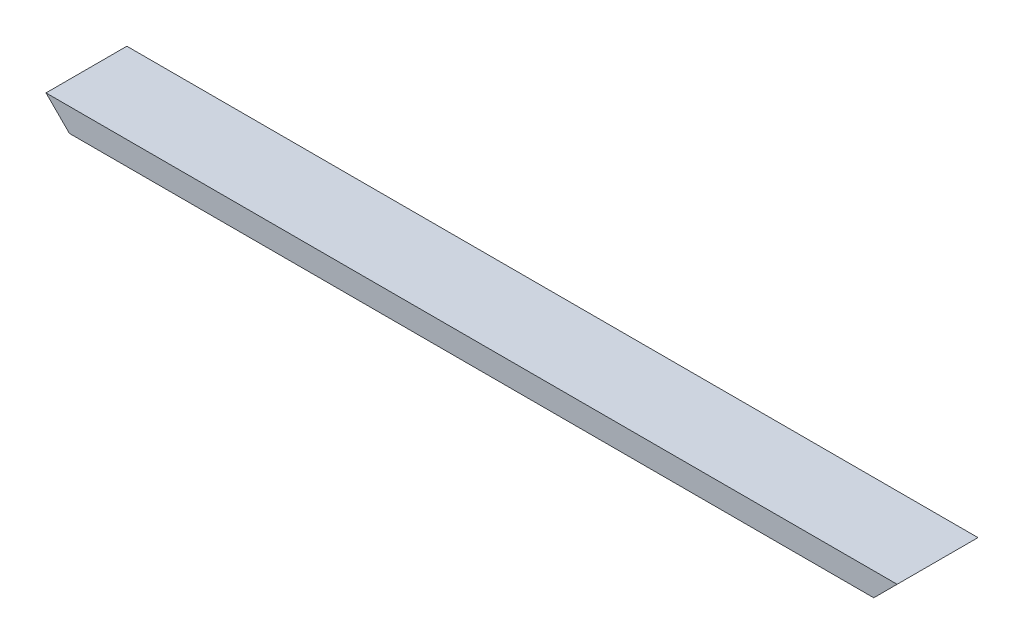
ISO-10303-21;
HEADER;
FILE_DESCRIPTION(('STEP AP214'),'2;1');
FILE_NAME('part.step','',(''),(''),'','','');
FILE_SCHEMA(('AUTOMOTIVE_DESIGN { 1 0 10303 214 1 1 1 1 }'));
ENDSEC;
DATA;
#1=APPLICATION_CONTEXT('core data for automotive mechanical design processes');
#2=APPLICATION_PROTOCOL_DEFINITION('international standard','automotive_design',2000,#1);
#3=PRODUCT_CONTEXT('',#1,'mechanical');
#4=PRODUCT('Part','Part','',(#3));
#5=PRODUCT_RELATED_PRODUCT_CATEGORY('part','',(#4));
#6=PRODUCT_DEFINITION_FORMATION('','',#4);
#7=PRODUCT_DEFINITION_CONTEXT('part definition',#1,'design');
#8=PRODUCT_DEFINITION('design','',#6,#7);
#9=PRODUCT_DEFINITION_SHAPE('','',#8);
#10=(LENGTH_UNIT() NAMED_UNIT(*) SI_UNIT(.MILLI.,.METRE.));
#11=(NAMED_UNIT(*) PLANE_ANGLE_UNIT() SI_UNIT($,.RADIAN.));
#12=(NAMED_UNIT(*) SI_UNIT($,.STERADIAN.) SOLID_ANGLE_UNIT());
#13=UNCERTAINTY_MEASURE_WITH_UNIT(LENGTH_MEASURE(1.E-05),#10,'distance_accuracy_value','');
#14=(GEOMETRIC_REPRESENTATION_CONTEXT(3) GLOBAL_UNCERTAINTY_ASSIGNED_CONTEXT((#13)) GLOBAL_UNIT_ASSIGNED_CONTEXT((#10,
#11,#12)) REPRESENTATION_CONTEXT('',''));
#15=CARTESIAN_POINT('',(0.,0.,0.));
#16=DIRECTION('',(0.,0.,1.));
#17=DIRECTION('',(1.,0.,0.));
#18=AXIS2_PLACEMENT_3D('',#15,#16,#17);
#19=CARTESIAN_POINT('',(400.,-5.5,-19.));
#20=DIRECTION('',(0.,0.,1.));
#21=DIRECTION('',(1.,0.,0.));
#22=AXIS2_PLACEMENT_3D('',#19,#20,#21);
#23=PLANE('',#22);
#24=DIRECTION('',(-1.,0.,0.));
#25=VECTOR('',#24,1.);
#26=CARTESIAN_POINT('',(400.,5.5,-19.));
#27=LINE('',#26,#25);
#28=CARTESIAN_POINT('',(400.,5.5,-19.));
#29=VERTEX_POINT('',#28);
#30=CARTESIAN_POINT('',(0.,5.5,-19.));
#31=VERTEX_POINT('',#30);
#32=EDGE_CURVE('E43',#29,#31,#27,.T.);
#33=ORIENTED_EDGE('',*,*,#32,.F.);
#34=DIRECTION('',(-0.707106781186544,-0.707106781186551,0.));
#35=VECTOR('',#34,1.);
#36=CARTESIAN_POINT('',(394.5,0.,-19.));
#37=LINE('',#36,#35);
#38=CARTESIAN_POINT('',(389.,-5.5,-19.));
#39=VERTEX_POINT('',#38);
#40=EDGE_CURVE('E58',#29,#39,#37,.T.);
#41=ORIENTED_EDGE('',*,*,#40,.T.);
#42=DIRECTION('',(-1.,0.,0.));
#43=VECTOR('',#42,1.);
#44=CARTESIAN_POINT('',(400.,-5.5,-19.));
#45=LINE('',#44,#43);
#46=CARTESIAN_POINT('',(10.9999999999998,-5.5,-19.));
#47=VERTEX_POINT('',#46);
#48=EDGE_CURVE('E120',#39,#47,#45,.T.);
#49=ORIENTED_EDGE('',*,*,#48,.T.);
#50=DIRECTION('',(0.707106781186543,-0.707106781186552,0.));
#51=VECTOR('',#50,1.);
#52=CARTESIAN_POINT('',(205.499999999997,-200.,-19.));
#53=LINE('',#52,#51);
#54=EDGE_CURVE('E132',#31,#47,#53,.T.);
#55=ORIENTED_EDGE('',*,*,#54,.F.);
#56=EDGE_LOOP('',(#33,#41,#49,#55));
#57=FACE_BOUND('',#56,.T.);
#58=ADVANCED_FACE('F36',(#57),#23,.F.);
#59=CARTESIAN_POINT('',(400.,-5.5,19.));
#60=DIRECTION('',(0.,0.,-1.));
#61=DIRECTION('',(-1.,0.,0.));
#62=AXIS2_PLACEMENT_3D('',#59,#60,#61);
#63=PLANE('',#62);
#64=DIRECTION('',(-1.,0.,0.));
#65=VECTOR('',#64,1.);
#66=CARTESIAN_POINT('',(400.,-5.5,19.));
#67=LINE('',#66,#65);
#68=CARTESIAN_POINT('',(389.,-5.5,19.));
#69=VERTEX_POINT('',#68);
#70=CARTESIAN_POINT('',(10.9999999999998,-5.5,19.));
#71=VERTEX_POINT('',#70);
#72=EDGE_CURVE('E111',#69,#71,#67,.T.);
#73=ORIENTED_EDGE('',*,*,#72,.F.);
#74=DIRECTION('',(0.707106781186544,0.707106781186551,0.));
#75=VECTOR('',#74,1.);
#76=CARTESIAN_POINT('',(394.5,0.,19.));
#77=LINE('',#76,#75);
#78=CARTESIAN_POINT('',(400.,5.5,19.));
#79=VERTEX_POINT('',#78);
#80=EDGE_CURVE('E114',#69,#79,#77,.T.);
#81=ORIENTED_EDGE('',*,*,#80,.T.);
#82=DIRECTION('',(-1.,0.,0.));
#83=VECTOR('',#82,1.);
#84=CARTESIAN_POINT('',(400.,5.5,19.));
#85=LINE('',#84,#83);
#86=CARTESIAN_POINT('',(0.,5.5,19.));
#87=VERTEX_POINT('',#86);
#88=EDGE_CURVE('E100',#79,#87,#85,.T.);
#89=ORIENTED_EDGE('',*,*,#88,.T.);
#90=DIRECTION('',(-0.707106781186543,0.707106781186552,0.));
#91=VECTOR('',#90,1.);
#92=CARTESIAN_POINT('',(205.499999999997,-200.,19.));
#93=LINE('',#92,#91);
#94=EDGE_CURVE('E133',#71,#87,#93,.T.);
#95=ORIENTED_EDGE('',*,*,#94,.F.);
#96=EDGE_LOOP('',(#73,#81,#89,#95));
#97=FACE_BOUND('',#96,.T.);
#98=ADVANCED_FACE('F115',(#97),#63,.F.);
#99=CARTESIAN_POINT('',(400.,-5.5,19.));
#100=DIRECTION('',(0.,1.,0.));
#101=DIRECTION('',(0.,0.,1.));
#102=AXIS2_PLACEMENT_3D('',#99,#100,#101);
#103=PLANE('',#102);
#104=ORIENTED_EDGE('',*,*,#48,.F.);
#105=DIRECTION('',(0.,0.,1.));
#106=VECTOR('',#105,1.);
#107=CARTESIAN_POINT('',(389.,-5.5,-521.43936201297));
#108=LINE('',#107,#106);
#109=EDGE_CURVE('E50',#39,#69,#108,.T.);
#110=ORIENTED_EDGE('',*,*,#109,.T.);
#111=ORIENTED_EDGE('',*,*,#72,.T.);
#112=DIRECTION('',(0.,0.,1.));
#113=VECTOR('',#112,1.);
#114=CARTESIAN_POINT('',(10.9999999999998,-5.5,-521.43936201297));
#115=LINE('',#114,#113);
#116=EDGE_CURVE('E135',#47,#71,#115,.T.);
#117=ORIENTED_EDGE('',*,*,#116,.F.);
#118=EDGE_LOOP('',(#104,#110,#111,#117));
#119=FACE_BOUND('',#118,.T.);
#120=ADVANCED_FACE('F196',(#119),#103,.F.);
#121=CARTESIAN_POINT('',(400.,-4.,17.5));
#122=DIRECTION('',(0.,0.,-1.));
#123=DIRECTION('',(-1.,0.,0.));
#124=AXIS2_PLACEMENT_3D('',#121,#122,#123);
#125=PLANE('',#124);
#126=DIRECTION('',(0.707106781186544,0.707106781186551,0.));
#127=VECTOR('',#126,1.);
#128=CARTESIAN_POINT('',(395.25,0.749999999999956,17.5));
#129=LINE('',#128,#127);
#130=CARTESIAN_POINT('',(390.5,-4.,17.5));
#131=VERTEX_POINT('',#130);
#132=CARTESIAN_POINT('',(398.5,4.,17.5));
#133=VERTEX_POINT('',#132);
#134=EDGE_CURVE('E117',#131,#133,#129,.T.);
#135=ORIENTED_EDGE('',*,*,#134,.F.);
#136=DIRECTION('',(-1.,0.,0.));
#137=VECTOR('',#136,1.);
#138=CARTESIAN_POINT('',(400.,-4.,17.5));
#139=LINE('',#138,#137);
#140=CARTESIAN_POINT('',(9.4999999999999,-4.,17.5));
#141=VERTEX_POINT('',#140);
#142=EDGE_CURVE('E123',#131,#141,#139,.T.);
#143=ORIENTED_EDGE('',*,*,#142,.T.);
#144=DIRECTION('',(-0.707106781186543,0.707106781186552,0.));
#145=VECTOR('',#144,1.);
#146=CARTESIAN_POINT('',(204.749999999997,-199.25,17.5));
#147=LINE('',#146,#145);
#148=CARTESIAN_POINT('',(1.49999999999995,4.,17.5));
#149=VERTEX_POINT('',#148);
#150=EDGE_CURVE('E136',#141,#149,#147,.T.);
#151=ORIENTED_EDGE('',*,*,#150,.T.);
#152=DIRECTION('',(-1.,0.,0.));
#153=VECTOR('',#152,1.);
#154=CARTESIAN_POINT('',(400.,4.,17.5));
#155=LINE('',#154,#153);
#156=EDGE_CURVE('E138',#133,#149,#155,.T.);
#157=ORIENTED_EDGE('',*,*,#156,.F.);
#158=EDGE_LOOP('',(#135,#143,#151,#157));
#159=FACE_BOUND('',#158,.T.);
#160=ADVANCED_FACE('F155',(#159),#125,.T.);
#161=CARTESIAN_POINT('',(400.,-4.,17.5));
#162=DIRECTION('',(0.,1.,0.));
#163=DIRECTION('',(0.,0.,1.));
#164=AXIS2_PLACEMENT_3D('',#161,#162,#163);
#165=PLANE('',#164);
#166=DIRECTION('',(0.,0.,1.));
#167=VECTOR('',#166,1.);
#168=CARTESIAN_POINT('',(390.5,-4.,17.5));
#169=LINE('',#168,#167);
#170=CARTESIAN_POINT('',(390.5,-4.,-17.5));
#171=VERTEX_POINT('',#170);
#172=EDGE_CURVE('E170',#171,#131,#169,.T.);
#173=ORIENTED_EDGE('',*,*,#172,.F.);
#174=DIRECTION('',(-1.,0.,0.));
#175=VECTOR('',#174,1.);
#176=CARTESIAN_POINT('',(400.,-4.,-17.5));
#177=LINE('',#176,#175);
#178=CARTESIAN_POINT('',(9.49999999999984,-3.99999999999998,-17.5));
#179=VERTEX_POINT('',#178);
#180=EDGE_CURVE('E147',#171,#179,#177,.T.);
#181=ORIENTED_EDGE('',*,*,#180,.T.);
#182=DIRECTION('',(0.,0.,1.));
#183=VECTOR('',#182,1.);
#184=CARTESIAN_POINT('',(9.4999999999999,-4.,17.5));
#185=LINE('',#184,#183);
#186=EDGE_CURVE('E141',#179,#141,#185,.T.);
#187=ORIENTED_EDGE('',*,*,#186,.T.);
#188=ORIENTED_EDGE('',*,*,#142,.F.);
#189=EDGE_LOOP('',(#173,#181,#187,#188));
#190=FACE_BOUND('',#189,.T.);
#191=ADVANCED_FACE('F163',(#190),#165,.T.);
#192=CARTESIAN_POINT('',(400.,-4.,-17.5));
#193=DIRECTION('',(0.,0.,1.));
#194=DIRECTION('',(1.,0.,0.));
#195=AXIS2_PLACEMENT_3D('',#192,#193,#194);
#196=PLANE('',#195);
#197=DIRECTION('',(-0.707106781186544,-0.707106781186551,0.));
#198=VECTOR('',#197,1.);
#199=CARTESIAN_POINT('',(395.25,0.749999999999956,-17.5));
#200=LINE('',#199,#198);
#201=CARTESIAN_POINT('',(398.5,4.,-17.5));
#202=VERTEX_POINT('',#201);
#203=EDGE_CURVE('E172',#202,#171,#200,.T.);
#204=ORIENTED_EDGE('',*,*,#203,.F.);
#205=DIRECTION('',(-1.,0.,0.));
#206=VECTOR('',#205,1.);
#207=CARTESIAN_POINT('',(400.,4.,-17.5));
#208=LINE('',#207,#206);
#209=CARTESIAN_POINT('',(1.49999999999995,4.,-17.5));
#210=VERTEX_POINT('',#209);
#211=EDGE_CURVE('E146',#202,#210,#208,.T.);
#212=ORIENTED_EDGE('',*,*,#211,.T.);
#213=DIRECTION('',(0.707106781186543,-0.707106781186552,0.));
#214=VECTOR('',#213,1.);
#215=CARTESIAN_POINT('',(204.749999999997,-199.25,-17.5));
#216=LINE('',#215,#214);
#217=EDGE_CURVE('E164',#210,#179,#216,.T.);
#218=ORIENTED_EDGE('',*,*,#217,.T.);
#219=ORIENTED_EDGE('',*,*,#180,.F.);
#220=EDGE_LOOP('',(#204,#212,#218,#219));
#221=FACE_BOUND('',#220,.T.);
#222=ADVANCED_FACE('F183',(#221),#196,.T.);
#223=CARTESIAN_POINT('',(400.,4.,17.5));
#224=DIRECTION('',(0.,-1.,0.));
#225=DIRECTION('',(0.,0.,-1.));
#226=AXIS2_PLACEMENT_3D('',#223,#224,#225);
#227=PLANE('',#226);
#228=DIRECTION('',(0.,0.,-1.));
#229=VECTOR('',#228,1.);
#230=CARTESIAN_POINT('',(398.5,4.,17.5));
#231=LINE('',#230,#229);
#232=EDGE_CURVE('E175',#133,#202,#231,.T.);
#233=ORIENTED_EDGE('',*,*,#232,.F.);
#234=ORIENTED_EDGE('',*,*,#156,.T.);
#235=DIRECTION('',(0.,0.,-1.));
#236=VECTOR('',#235,1.);
#237=CARTESIAN_POINT('',(1.49999999999995,4.,17.5));
#238=LINE('',#237,#236);
#239=EDGE_CURVE('E11',#149,#210,#238,.T.);
#240=ORIENTED_EDGE('',*,*,#239,.T.);
#241=ORIENTED_EDGE('',*,*,#211,.F.);
#242=EDGE_LOOP('',(#233,#234,#240,#241));
#243=FACE_BOUND('',#242,.T.);
#244=ADVANCED_FACE('F181',(#243),#227,.T.);
#245=CARTESIAN_POINT('',(400.,5.5,19.));
#246=DIRECTION('',(0.,-1.,0.));
#247=DIRECTION('',(0.,0.,-1.));
#248=AXIS2_PLACEMENT_3D('',#245,#246,#247);
#249=PLANE('',#248);
#250=DIRECTION('',(0.,0.,1.));
#251=VECTOR('',#250,1.);
#252=CARTESIAN_POINT('',(0.,5.5,19.));
#253=LINE('',#252,#251);
#254=EDGE_CURVE('E107',#31,#87,#253,.T.);
#255=ORIENTED_EDGE('',*,*,#254,.T.);
#256=ORIENTED_EDGE('',*,*,#88,.F.);
#257=DIRECTION('',(0.,0.,1.));
#258=VECTOR('',#257,1.);
#259=CARTESIAN_POINT('',(400.,5.5,19.));
#260=LINE('',#259,#258);
#261=EDGE_CURVE('E105',#29,#79,#260,.T.);
#262=ORIENTED_EDGE('',*,*,#261,.F.);
#263=ORIENTED_EDGE('',*,*,#32,.T.);
#264=EDGE_LOOP('',(#255,#256,#262,#263));
#265=FACE_BOUND('',#264,.T.);
#266=ADVANCED_FACE('F102',(#265),#249,.F.);
#267=CARTESIAN_POINT('',(0.,5.5,-521.43936201297));
#268=DIRECTION('',(-0.707106781186552,-0.707106781186543,0.));
#269=DIRECTION('',(0.707106781186543,-0.707106781186552,0.));
#270=AXIS2_PLACEMENT_3D('',#267,#268,#269);
#271=PLANE('',#270);
#272=ORIENTED_EDGE('',*,*,#150,.F.);
#273=ORIENTED_EDGE('',*,*,#186,.F.);
#274=ORIENTED_EDGE('',*,*,#217,.F.);
#275=ORIENTED_EDGE('',*,*,#239,.F.);
#276=EDGE_LOOP('',(#272,#273,#274,#275));
#277=FACE_BOUND('',#276,.T.);
#278=ORIENTED_EDGE('',*,*,#254,.F.);
#279=ORIENTED_EDGE('',*,*,#54,.T.);
#280=ORIENTED_EDGE('',*,*,#116,.T.);
#281=ORIENTED_EDGE('',*,*,#94,.T.);
#282=EDGE_LOOP('',(#278,#279,#280,#281));
#283=FACE_BOUND('',#282,.T.);
#284=ADVANCED_FACE('F130',(#277,#283),#271,.T.);
#285=CARTESIAN_POINT('',(400.,5.5,-521.43936201297));
#286=DIRECTION('',(-0.707106781186551,0.707106781186544,0.));
#287=DIRECTION('',(-0.707106781186544,-0.707106781186551,0.));
#288=AXIS2_PLACEMENT_3D('',#285,#286,#287);
#289=PLANE('',#288);
#290=ORIENTED_EDGE('',*,*,#172,.T.);
#291=ORIENTED_EDGE('',*,*,#134,.T.);
#292=ORIENTED_EDGE('',*,*,#232,.T.);
#293=ORIENTED_EDGE('',*,*,#203,.T.);
#294=EDGE_LOOP('',(#290,#291,#292,#293));
#295=FACE_BOUND('',#294,.T.);
#296=ORIENTED_EDGE('',*,*,#40,.F.);
#297=ORIENTED_EDGE('',*,*,#261,.T.);
#298=ORIENTED_EDGE('',*,*,#80,.F.);
#299=ORIENTED_EDGE('',*,*,#109,.F.);
#300=EDGE_LOOP('',(#296,#297,#298,#299));
#301=FACE_BOUND('',#300,.T.);
#302=ADVANCED_FACE('F119',(#295,#301),#289,.F.);
#303=CLOSED_SHELL('',(#58,#98,#120,#160,#191,#222,#244,#266,#284,#302));
#304=MANIFOLD_SOLID_BREP('B2',#303);
#305=ADVANCED_BREP_SHAPE_REPRESENTATION('',(#18,#304),#14);
#306=SHAPE_DEFINITION_REPRESENTATION(#9,#305);
ENDSEC;
END-ISO-10303-21;
